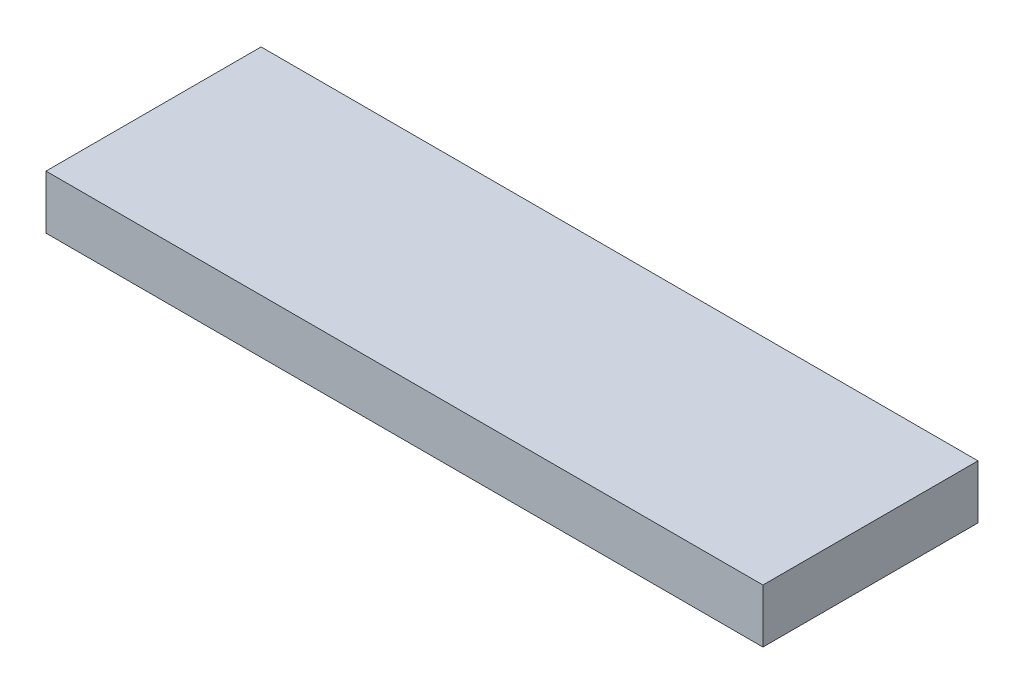
ISO-10303-21;
HEADER;
FILE_DESCRIPTION(('STEP AP214'),'2;1');
FILE_NAME('part.step','',(''),(''),'','','');
FILE_SCHEMA(('AUTOMOTIVE_DESIGN { 1 0 10303 214 1 1 1 1 }'));
ENDSEC;
DATA;
#1=APPLICATION_CONTEXT('core data for automotive mechanical design processes');
#2=APPLICATION_PROTOCOL_DEFINITION('international standard','automotive_design',2000,#1);
#3=PRODUCT_CONTEXT('',#1,'mechanical');
#4=PRODUCT('Part','Part','',(#3));
#5=PRODUCT_RELATED_PRODUCT_CATEGORY('part','',(#4));
#6=PRODUCT_DEFINITION_FORMATION('','',#4);
#7=PRODUCT_DEFINITION_CONTEXT('part definition',#1,'design');
#8=PRODUCT_DEFINITION('design','',#6,#7);
#9=PRODUCT_DEFINITION_SHAPE('','',#8);
#10=(LENGTH_UNIT() NAMED_UNIT(*) SI_UNIT(.MILLI.,.METRE.));
#11=(NAMED_UNIT(*) PLANE_ANGLE_UNIT() SI_UNIT($,.RADIAN.));
#12=(NAMED_UNIT(*) SI_UNIT($,.STERADIAN.) SOLID_ANGLE_UNIT());
#13=UNCERTAINTY_MEASURE_WITH_UNIT(LENGTH_MEASURE(1.E-05),#10,'distance_accuracy_value','');
#14=(GEOMETRIC_REPRESENTATION_CONTEXT(3) GLOBAL_UNCERTAINTY_ASSIGNED_CONTEXT((#13)) GLOBAL_UNIT_ASSIGNED_CONTEXT((#10,
#11,#12)) REPRESENTATION_CONTEXT('',''));
#15=CARTESIAN_POINT('',(0.,0.,0.));
#16=DIRECTION('',(0.,0.,1.));
#17=DIRECTION('',(1.,0.,0.));
#18=AXIS2_PLACEMENT_3D('',#15,#16,#17);
#19=CARTESIAN_POINT('',(100.,15.,30.));
#20=DIRECTION('',(-1.,0.,0.));
#21=DIRECTION('',(0.,0.,1.));
#22=AXIS2_PLACEMENT_3D('',#19,#20,#21);
#23=PLANE('',#22);
#24=DIRECTION('',(0.,0.,-1.));
#25=VECTOR('',#24,1.);
#26=CARTESIAN_POINT('',(100.,0.,30.));
#27=LINE('',#26,#25);
#28=CARTESIAN_POINT('',(100.,0.,30.));
#29=VERTEX_POINT('',#28);
#30=CARTESIAN_POINT('',(100.,0.,-30.));
#31=VERTEX_POINT('',#30);
#32=EDGE_CURVE('E97',#29,#31,#27,.T.);
#33=ORIENTED_EDGE('',*,*,#32,.T.);
#34=DIRECTION('',(0.,-1.,0.));
#35=VECTOR('',#34,1.);
#36=CARTESIAN_POINT('',(100.,15.,-30.));
#37=LINE('',#36,#35);
#38=CARTESIAN_POINT('',(100.,15.,-30.));
#39=VERTEX_POINT('',#38);
#40=EDGE_CURVE('E11',#39,#31,#37,.T.);
#41=ORIENTED_EDGE('',*,*,#40,.F.);
#42=DIRECTION('',(0.,0.,-1.));
#43=VECTOR('',#42,1.);
#44=CARTESIAN_POINT('',(100.,15.,30.));
#45=LINE('',#44,#43);
#46=CARTESIAN_POINT('',(100.,15.,30.));
#47=VERTEX_POINT('',#46);
#48=EDGE_CURVE('E85',#47,#39,#45,.T.);
#49=ORIENTED_EDGE('',*,*,#48,.F.);
#50=DIRECTION('',(0.,-1.,0.));
#51=VECTOR('',#50,1.);
#52=CARTESIAN_POINT('',(100.,15.,30.));
#53=LINE('',#52,#51);
#54=EDGE_CURVE('E93',#47,#29,#53,.T.);
#55=ORIENTED_EDGE('',*,*,#54,.T.);
#56=EDGE_LOOP('',(#33,#41,#49,#55));
#57=FACE_BOUND('',#56,.T.);
#58=ADVANCED_FACE('F34',(#57),#23,.F.);
#59=CARTESIAN_POINT('',(-100.,15.,-30.));
#60=DIRECTION('',(0.,0.,1.));
#61=DIRECTION('',(1.,0.,0.));
#62=AXIS2_PLACEMENT_3D('',#59,#60,#61);
#63=PLANE('',#62);
#64=DIRECTION('',(-1.,0.,0.));
#65=VECTOR('',#64,1.);
#66=CARTESIAN_POINT('',(-100.,0.,-30.));
#67=LINE('',#66,#65);
#68=CARTESIAN_POINT('',(-100.,0.,-30.));
#69=VERTEX_POINT('',#68);
#70=EDGE_CURVE('E89',#31,#69,#67,.T.);
#71=ORIENTED_EDGE('',*,*,#70,.T.);
#72=DIRECTION('',(0.,-1.,0.));
#73=VECTOR('',#72,1.);
#74=CARTESIAN_POINT('',(-100.,15.,-30.));
#75=LINE('',#74,#73);
#76=CARTESIAN_POINT('',(-100.,15.,-30.));
#77=VERTEX_POINT('',#76);
#78=EDGE_CURVE('E42',#77,#69,#75,.T.);
#79=ORIENTED_EDGE('',*,*,#78,.F.);
#80=DIRECTION('',(-1.,0.,0.));
#81=VECTOR('',#80,1.);
#82=CARTESIAN_POINT('',(-100.,15.,-30.));
#83=LINE('',#82,#81);
#84=EDGE_CURVE('E80',#39,#77,#83,.T.);
#85=ORIENTED_EDGE('',*,*,#84,.F.);
#86=ORIENTED_EDGE('',*,*,#40,.T.);
#87=EDGE_LOOP('',(#71,#79,#85,#86));
#88=FACE_BOUND('',#87,.T.);
#89=ADVANCED_FACE('F88',(#88),#63,.F.);
#90=CARTESIAN_POINT('',(-100.,15.,30.));
#91=DIRECTION('',(1.,0.,0.));
#92=DIRECTION('',(0.,0.,-1.));
#93=AXIS2_PLACEMENT_3D('',#90,#91,#92);
#94=PLANE('',#93);
#95=DIRECTION('',(0.,0.,1.));
#96=VECTOR('',#95,1.);
#97=CARTESIAN_POINT('',(-100.,0.,30.));
#98=LINE('',#97,#96);
#99=CARTESIAN_POINT('',(-100.,0.,30.));
#100=VERTEX_POINT('',#99);
#101=EDGE_CURVE('E67',#69,#100,#98,.T.);
#102=ORIENTED_EDGE('',*,*,#101,.T.);
#103=DIRECTION('',(0.,-1.,0.));
#104=VECTOR('',#103,1.);
#105=CARTESIAN_POINT('',(-100.,15.,30.));
#106=LINE('',#105,#104);
#107=CARTESIAN_POINT('',(-100.,15.,30.));
#108=VERTEX_POINT('',#107);
#109=EDGE_CURVE('E90',#108,#100,#106,.T.);
#110=ORIENTED_EDGE('',*,*,#109,.F.);
#111=DIRECTION('',(0.,0.,1.));
#112=VECTOR('',#111,1.);
#113=CARTESIAN_POINT('',(-100.,15.,30.));
#114=LINE('',#113,#112);
#115=EDGE_CURVE('E83',#77,#108,#114,.T.);
#116=ORIENTED_EDGE('',*,*,#115,.F.);
#117=ORIENTED_EDGE('',*,*,#78,.T.);
#118=EDGE_LOOP('',(#102,#110,#116,#117));
#119=FACE_BOUND('',#118,.T.);
#120=ADVANCED_FACE('F91',(#119),#94,.F.);
#121=CARTESIAN_POINT('',(-100.,15.,30.));
#122=DIRECTION('',(0.,0.,-1.));
#123=DIRECTION('',(-1.,0.,0.));
#124=AXIS2_PLACEMENT_3D('',#121,#122,#123);
#125=PLANE('',#124);
#126=DIRECTION('',(1.,0.,0.));
#127=VECTOR('',#126,1.);
#128=CARTESIAN_POINT('',(-100.,0.,30.));
#129=LINE('',#128,#127);
#130=EDGE_CURVE('E73',#100,#29,#129,.T.);
#131=ORIENTED_EDGE('',*,*,#130,.T.);
#132=ORIENTED_EDGE('',*,*,#54,.F.);
#133=DIRECTION('',(1.,0.,0.));
#134=VECTOR('',#133,1.);
#135=CARTESIAN_POINT('',(-100.,15.,30.));
#136=LINE('',#135,#134);
#137=EDGE_CURVE('E50',#108,#47,#136,.T.);
#138=ORIENTED_EDGE('',*,*,#137,.F.);
#139=ORIENTED_EDGE('',*,*,#109,.T.);
#140=EDGE_LOOP('',(#131,#132,#138,#139));
#141=FACE_BOUND('',#140,.T.);
#142=ADVANCED_FACE('F104',(#141),#125,.F.);
#143=CARTESIAN_POINT('',(0.,15.,0.));
#144=DIRECTION('',(0.,-1.,0.));
#145=DIRECTION('',(0.,0.,-1.));
#146=AXIS2_PLACEMENT_3D('',#143,#144,#145);
#147=PLANE('',#146);
#148=ORIENTED_EDGE('',*,*,#48,.T.);
#149=ORIENTED_EDGE('',*,*,#84,.T.);
#150=ORIENTED_EDGE('',*,*,#115,.T.);
#151=ORIENTED_EDGE('',*,*,#137,.T.);
#152=EDGE_LOOP('',(#148,#149,#150,#151));
#153=FACE_BOUND('',#152,.T.);
#154=ADVANCED_FACE('F81',(#153),#147,.F.);
#155=CARTESIAN_POINT('',(0.,0.,0.));
#156=DIRECTION('',(0.,-1.,0.));
#157=DIRECTION('',(0.,0.,-1.));
#158=AXIS2_PLACEMENT_3D('',#155,#156,#157);
#159=PLANE('',#158);
#160=ORIENTED_EDGE('',*,*,#32,.F.);
#161=ORIENTED_EDGE('',*,*,#130,.F.);
#162=ORIENTED_EDGE('',*,*,#101,.F.);
#163=ORIENTED_EDGE('',*,*,#70,.F.);
#164=EDGE_LOOP('',(#160,#161,#162,#163));
#165=FACE_BOUND('',#164,.T.);
#166=ADVANCED_FACE('F107',(#165),#159,.T.);
#167=CLOSED_SHELL('',(#58,#89,#120,#142,#154,#166));
#168=MANIFOLD_SOLID_BREP('B2',#167);
#169=ADVANCED_BREP_SHAPE_REPRESENTATION('',(#18,#168),#14);
#170=SHAPE_DEFINITION_REPRESENTATION(#9,#169);
ENDSEC;
END-ISO-10303-21;
